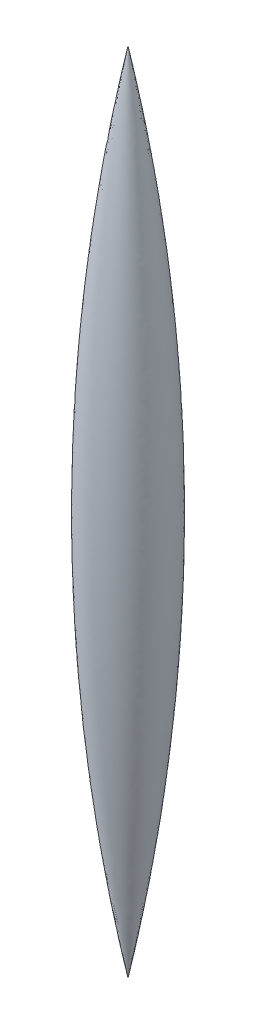
ISO-10303-21;
HEADER;
FILE_DESCRIPTION(('STEP AP214'),'2;1');
FILE_NAME('part.step','',(''),(''),'','','');
FILE_SCHEMA(('AUTOMOTIVE_DESIGN { 1 0 10303 214 1 1 1 1 }'));
ENDSEC;
DATA;
#1=APPLICATION_CONTEXT('core data for automotive mechanical design processes');
#2=APPLICATION_PROTOCOL_DEFINITION('international standard','automotive_design',2000,#1);
#3=PRODUCT_CONTEXT('',#1,'mechanical');
#4=PRODUCT('Part','Part','',(#3));
#5=PRODUCT_RELATED_PRODUCT_CATEGORY('part','',(#4));
#6=PRODUCT_DEFINITION_FORMATION('','',#4);
#7=PRODUCT_DEFINITION_CONTEXT('part definition',#1,'design');
#8=PRODUCT_DEFINITION('design','',#6,#7);
#9=PRODUCT_DEFINITION_SHAPE('','',#8);
#10=(LENGTH_UNIT() NAMED_UNIT(*) SI_UNIT(.MILLI.,.METRE.));
#11=(NAMED_UNIT(*) PLANE_ANGLE_UNIT() SI_UNIT($,.RADIAN.));
#12=(NAMED_UNIT(*) SI_UNIT($,.STERADIAN.) SOLID_ANGLE_UNIT());
#13=UNCERTAINTY_MEASURE_WITH_UNIT(LENGTH_MEASURE(1.E-05),#10,'distance_accuracy_value','');
#14=(GEOMETRIC_REPRESENTATION_CONTEXT(3) GLOBAL_UNCERTAINTY_ASSIGNED_CONTEXT((#13)) GLOBAL_UNIT_ASSIGNED_CONTEXT((#10,
#11,#12)) REPRESENTATION_CONTEXT('',''));
#15=CARTESIAN_POINT('',(0.,0.,0.));
#16=DIRECTION('',(0.,0.,1.));
#17=DIRECTION('',(1.,0.,0.));
#18=AXIS2_PLACEMENT_3D('',#15,#16,#17);
#19=CARTESIAN_POINT('',(317.686611739726,2.12215642806496E-12,0.));
#20=DIRECTION('',(0.,0.,-1.));
#21=DIRECTION('',(-1.,0.,0.));
#22=AXIS2_PLACEMENT_3D('',#19,#20,#21);
#23=CIRCLE('',#22,323.970729046109);
#24=TRIMMED_CURVE('',#23,(PARAMETER_VALUE(-0.197282594171308)),
(PARAMETER_VALUE(0.197282594171308)),.T.,.PARAMETER.);
#25=CARTESIAN_POINT('',(0.,1.0129595515754E-12,0.));
#26=DIRECTION('',(0.,1.,0.));
#27=AXIS1_PLACEMENT('',#25,#26);
#28=SURFACE_OF_REVOLUTION('',#24,#27);
#29=CARTESIAN_POINT('',(-2.21709065016539E-13,63.5,0.));
#30=VERTEX_POINT('',#29);
#31=VERTEX_LOOP('',#30);
#32=FACE_BOUND('',#31,.T.);
#33=CARTESIAN_POINT('',(2.21709065016539E-13,-63.5,0.));
#34=VERTEX_POINT('',#33);
#35=VERTEX_LOOP('',#34);
#36=FACE_BOUND('',#35,.T.);
#37=ADVANCED_FACE('F33',(#32,#36),#28,.T.);
#38=CLOSED_SHELL('',(#37));
#39=MANIFOLD_SOLID_BREP('B2',#38);
#40=ADVANCED_BREP_SHAPE_REPRESENTATION('',(#18,#39),#14);
#41=SHAPE_DEFINITION_REPRESENTATION(#9,#40);
ENDSEC;
END-ISO-10303-21;
